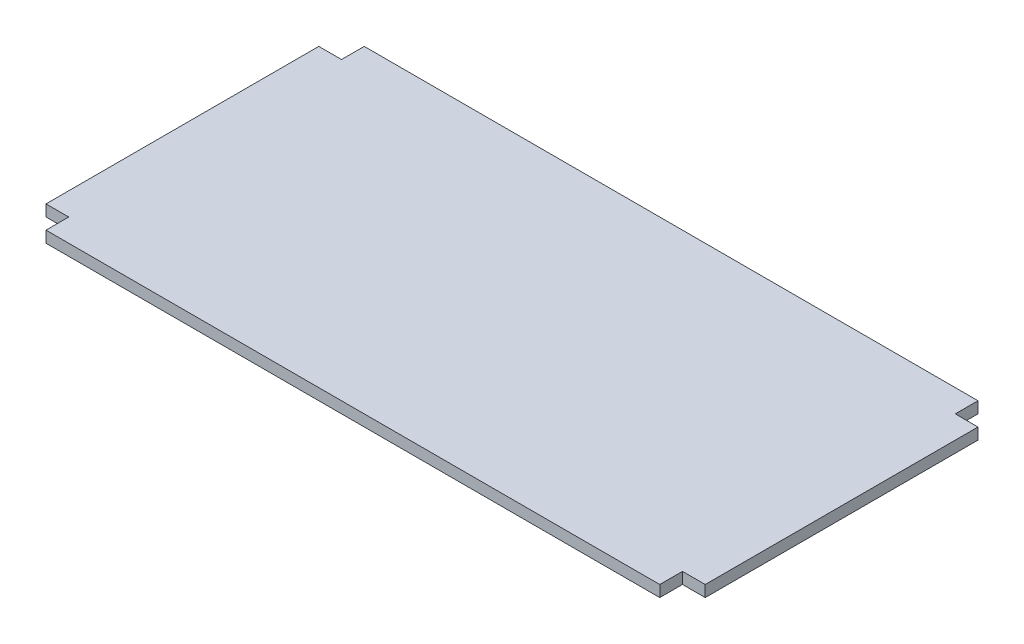
ISO-10303-21;
HEADER;
FILE_DESCRIPTION(('STEP AP214'),'2;1');
FILE_NAME('part.step','',(''),(''),'','','');
FILE_SCHEMA(('AUTOMOTIVE_DESIGN { 1 0 10303 214 1 1 1 1 }'));
ENDSEC;
DATA;
#1=APPLICATION_CONTEXT('core data for automotive mechanical design processes');
#2=APPLICATION_PROTOCOL_DEFINITION('international standard','automotive_design',2000,#1);
#3=PRODUCT_CONTEXT('',#1,'mechanical');
#4=PRODUCT('Part','Part','',(#3));
#5=PRODUCT_RELATED_PRODUCT_CATEGORY('part','',(#4));
#6=PRODUCT_DEFINITION_FORMATION('','',#4);
#7=PRODUCT_DEFINITION_CONTEXT('part definition',#1,'design');
#8=PRODUCT_DEFINITION('design','',#6,#7);
#9=PRODUCT_DEFINITION_SHAPE('','',#8);
#10=(LENGTH_UNIT() NAMED_UNIT(*) SI_UNIT(.MILLI.,.METRE.));
#11=(NAMED_UNIT(*) PLANE_ANGLE_UNIT() SI_UNIT($,.RADIAN.));
#12=(NAMED_UNIT(*) SI_UNIT($,.STERADIAN.) SOLID_ANGLE_UNIT());
#13=UNCERTAINTY_MEASURE_WITH_UNIT(LENGTH_MEASURE(1.E-05),#10,'distance_accuracy_value','');
#14=(GEOMETRIC_REPRESENTATION_CONTEXT(3) GLOBAL_UNCERTAINTY_ASSIGNED_CONTEXT((#13)) GLOBAL_UNIT_ASSIGNED_CONTEXT((#10,
#11,#12)) REPRESENTATION_CONTEXT('',''));
#15=CARTESIAN_POINT('',(0.,0.,0.));
#16=DIRECTION('',(0.,0.,1.));
#17=DIRECTION('',(1.,0.,0.));
#18=AXIS2_PLACEMENT_3D('',#15,#16,#17);
#19=CARTESIAN_POINT('',(0.,12.7,-152.4));
#20=DIRECTION('',(0.,0.,1.));
#21=DIRECTION('',(1.,0.,0.));
#22=AXIS2_PLACEMENT_3D('',#19,#20,#21);
#23=PLANE('',#22);
#24=DIRECTION('',(-1.,0.,0.));
#25=VECTOR('',#24,1.);
#26=CARTESIAN_POINT('',(0.,12.7,-152.4));
#27=LINE('',#26,#25);
#28=CARTESIAN_POINT('',(368.3,12.7,-152.4));
#29=VERTEX_POINT('',#28);
#30=CARTESIAN_POINT('',(342.9,12.7,-152.4));
#31=VERTEX_POINT('',#30);
#32=EDGE_CURVE('E170',#29,#31,#27,.T.);
#33=ORIENTED_EDGE('',*,*,#32,.F.);
#34=DIRECTION('',(0.,1.,0.));
#35=VECTOR('',#34,1.);
#36=CARTESIAN_POINT('',(368.3,0.,-152.4));
#37=LINE('',#36,#35);
#38=CARTESIAN_POINT('',(368.3,0.,-152.4));
#39=VERTEX_POINT('',#38);
#40=EDGE_CURVE('E237',#39,#29,#37,.T.);
#41=ORIENTED_EDGE('',*,*,#40,.F.);
#42=DIRECTION('',(-1.,0.,0.));
#43=VECTOR('',#42,1.);
#44=CARTESIAN_POINT('',(0.,0.,-152.4));
#45=LINE('',#44,#43);
#46=CARTESIAN_POINT('',(342.9,0.,-152.4));
#47=VERTEX_POINT('',#46);
#48=EDGE_CURVE('E197',#39,#47,#45,.T.);
#49=ORIENTED_EDGE('',*,*,#48,.T.);
#50=DIRECTION('',(0.,-1.,0.));
#51=VECTOR('',#50,1.);
#52=CARTESIAN_POINT('',(342.9,12.7,-152.4));
#53=LINE('',#52,#51);
#54=EDGE_CURVE('E11',#31,#47,#53,.T.);
#55=ORIENTED_EDGE('',*,*,#54,.F.);
#56=EDGE_LOOP('',(#33,#41,#49,#55));
#57=FACE_BOUND('',#56,.T.);
#58=ADVANCED_FACE('F40',(#57),#23,.F.);
#59=CARTESIAN_POINT('',(342.9,12.7,-4.99600361081321E-13));
#60=DIRECTION('',(1.,0.,0.));
#61=DIRECTION('',(0.,0.,-1.));
#62=AXIS2_PLACEMENT_3D('',#59,#60,#61);
#63=PLANE('',#62);
#64=DIRECTION('',(0.,1.,0.));
#65=VECTOR('',#64,1.);
#66=CARTESIAN_POINT('',(342.9,0.,-177.8));
#67=LINE('',#66,#65);
#68=CARTESIAN_POINT('',(342.9,0.,-177.8));
#69=VERTEX_POINT('',#68);
#70=CARTESIAN_POINT('',(342.9,12.7,-177.8));
#71=VERTEX_POINT('',#70);
#72=EDGE_CURVE('E55',#69,#71,#67,.T.);
#73=ORIENTED_EDGE('',*,*,#72,.T.);
#74=DIRECTION('',(0.,0.,1.));
#75=VECTOR('',#74,1.);
#76=CARTESIAN_POINT('',(342.9,12.7,-4.99600361081321E-13));
#77=LINE('',#76,#75);
#78=EDGE_CURVE('E217',#71,#31,#77,.T.);
#79=ORIENTED_EDGE('',*,*,#78,.T.);
#80=ORIENTED_EDGE('',*,*,#54,.T.);
#81=DIRECTION('',(0.,0.,1.));
#82=VECTOR('',#81,1.);
#83=CARTESIAN_POINT('',(342.9,0.,-4.99600361081321E-13));
#84=LINE('',#83,#82);
#85=EDGE_CURVE('E194',#69,#47,#84,.T.);
#86=ORIENTED_EDGE('',*,*,#85,.F.);
#87=EDGE_LOOP('',(#73,#79,#80,#86));
#88=FACE_BOUND('',#87,.T.);
#89=ADVANCED_FACE('F270',(#88),#63,.T.);
#90=CARTESIAN_POINT('',(-342.9,12.7,-4.99600361081321E-13));
#91=DIRECTION('',(1.,0.,0.));
#92=DIRECTION('',(0.,0.,-1.));
#93=AXIS2_PLACEMENT_3D('',#90,#91,#92);
#94=PLANE('',#93);
#95=DIRECTION('',(0.,0.,1.));
#96=VECTOR('',#95,1.);
#97=CARTESIAN_POINT('',(-342.9,12.7,-4.99600361081321E-13));
#98=LINE('',#97,#96);
#99=CARTESIAN_POINT('',(-342.9,12.7,-177.8));
#100=VERTEX_POINT('',#99);
#101=CARTESIAN_POINT('',(-342.9,12.7,-152.4));
#102=VERTEX_POINT('',#101);
#103=EDGE_CURVE('E190',#100,#102,#98,.T.);
#104=ORIENTED_EDGE('',*,*,#103,.F.);
#105=DIRECTION('',(0.,1.,0.));
#106=VECTOR('',#105,1.);
#107=CARTESIAN_POINT('',(-342.9,0.,-177.8));
#108=LINE('',#107,#106);
#109=CARTESIAN_POINT('',(-342.9,0.,-177.8));
#110=VERTEX_POINT('',#109);
#111=EDGE_CURVE('E192',#110,#100,#108,.T.);
#112=ORIENTED_EDGE('',*,*,#111,.F.);
#113=DIRECTION('',(0.,0.,1.));
#114=VECTOR('',#113,1.);
#115=CARTESIAN_POINT('',(-342.9,0.,-4.99600361081321E-13));
#116=LINE('',#115,#114);
#117=CARTESIAN_POINT('',(-342.9,0.,-152.4));
#118=VERTEX_POINT('',#117);
#119=EDGE_CURVE('E160',#110,#118,#116,.T.);
#120=ORIENTED_EDGE('',*,*,#119,.T.);
#121=DIRECTION('',(0.,-1.,0.));
#122=VECTOR('',#121,1.);
#123=CARTESIAN_POINT('',(-342.9,12.7,-152.4));
#124=LINE('',#123,#122);
#125=EDGE_CURVE('E48',#102,#118,#124,.T.);
#126=ORIENTED_EDGE('',*,*,#125,.F.);
#127=EDGE_LOOP('',(#104,#112,#120,#126));
#128=FACE_BOUND('',#127,.T.);
#129=ADVANCED_FACE('F188',(#128),#94,.F.);
#130=CARTESIAN_POINT('',(0.,12.7,-152.4));
#131=DIRECTION('',(0.,0.,-1.));
#132=DIRECTION('',(-1.,0.,0.));
#133=AXIS2_PLACEMENT_3D('',#130,#131,#132);
#134=PLANE('',#133);
#135=DIRECTION('',(0.,1.,0.));
#136=VECTOR('',#135,1.);
#137=CARTESIAN_POINT('',(-368.3,0.,-152.4));
#138=LINE('',#137,#136);
#139=CARTESIAN_POINT('',(-368.3,0.,-152.4));
#140=VERTEX_POINT('',#139);
#141=CARTESIAN_POINT('',(-368.3,12.7,-152.4));
#142=VERTEX_POINT('',#141);
#143=EDGE_CURVE('E63',#140,#142,#138,.T.);
#144=ORIENTED_EDGE('',*,*,#143,.T.);
#145=DIRECTION('',(1.,0.,0.));
#146=VECTOR('',#145,1.);
#147=CARTESIAN_POINT('',(0.,12.7,-152.4));
#148=LINE('',#147,#146);
#149=EDGE_CURVE('E184',#142,#102,#148,.T.);
#150=ORIENTED_EDGE('',*,*,#149,.T.);
#151=ORIENTED_EDGE('',*,*,#125,.T.);
#152=DIRECTION('',(1.,0.,0.));
#153=VECTOR('',#152,1.);
#154=CARTESIAN_POINT('',(0.,0.,-152.4));
#155=LINE('',#154,#153);
#156=EDGE_CURVE('E154',#140,#118,#155,.T.);
#157=ORIENTED_EDGE('',*,*,#156,.F.);
#158=EDGE_LOOP('',(#144,#150,#151,#157));
#159=FACE_BOUND('',#158,.T.);
#160=ADVANCED_FACE('F182',(#159),#134,.T.);
#161=CARTESIAN_POINT('',(0.,12.7,152.4));
#162=DIRECTION('',(0.,0.,-1.));
#163=DIRECTION('',(-1.,0.,0.));
#164=AXIS2_PLACEMENT_3D('',#161,#162,#163);
#165=PLANE('',#164);
#166=DIRECTION('',(1.,0.,0.));
#167=VECTOR('',#166,1.);
#168=CARTESIAN_POINT('',(0.,12.7,152.4));
#169=LINE('',#168,#167);
#170=CARTESIAN_POINT('',(-368.3,12.7,152.4));
#171=VERTEX_POINT('',#170);
#172=CARTESIAN_POINT('',(-342.9,12.7,152.4));
#173=VERTEX_POINT('',#172);
#174=EDGE_CURVE('E145',#171,#173,#169,.T.);
#175=ORIENTED_EDGE('',*,*,#174,.F.);
#176=DIRECTION('',(0.,1.,0.));
#177=VECTOR('',#176,1.);
#178=CARTESIAN_POINT('',(-368.3,0.,152.4));
#179=LINE('',#178,#177);
#180=CARTESIAN_POINT('',(-368.3,0.,152.4));
#181=VERTEX_POINT('',#180);
#182=EDGE_CURVE('E129',#181,#171,#179,.T.);
#183=ORIENTED_EDGE('',*,*,#182,.F.);
#184=DIRECTION('',(1.,0.,0.));
#185=VECTOR('',#184,1.);
#186=CARTESIAN_POINT('',(0.,0.,152.4));
#187=LINE('',#186,#185);
#188=CARTESIAN_POINT('',(-342.9,0.,152.4));
#189=VERTEX_POINT('',#188);
#190=EDGE_CURVE('E142',#181,#189,#187,.T.);
#191=ORIENTED_EDGE('',*,*,#190,.T.);
#192=DIRECTION('',(0.,-1.,0.));
#193=VECTOR('',#192,1.);
#194=CARTESIAN_POINT('',(-342.9,12.7,152.4));
#195=LINE('',#194,#193);
#196=EDGE_CURVE('E175',#173,#189,#195,.T.);
#197=ORIENTED_EDGE('',*,*,#196,.F.);
#198=EDGE_LOOP('',(#175,#183,#191,#197));
#199=FACE_BOUND('',#198,.T.);
#200=ADVANCED_FACE('F140',(#199),#165,.F.);
#201=CARTESIAN_POINT('',(-342.9,12.7,0.));
#202=DIRECTION('',(-1.,0.,0.));
#203=DIRECTION('',(0.,0.,1.));
#204=AXIS2_PLACEMENT_3D('',#201,#202,#203);
#205=PLANE('',#204);
#206=DIRECTION('',(0.,1.,0.));
#207=VECTOR('',#206,1.);
#208=CARTESIAN_POINT('',(-342.9,0.,177.8));
#209=LINE('',#208,#207);
#210=CARTESIAN_POINT('',(-342.9,0.,177.8));
#211=VERTEX_POINT('',#210);
#212=CARTESIAN_POINT('',(-342.9,12.7,177.8));
#213=VERTEX_POINT('',#212);
#214=EDGE_CURVE('E226',#211,#213,#209,.T.);
#215=ORIENTED_EDGE('',*,*,#214,.T.);
#216=DIRECTION('',(0.,0.,-1.));
#217=VECTOR('',#216,1.);
#218=CARTESIAN_POINT('',(-342.9,12.7,0.));
#219=LINE('',#218,#217);
#220=EDGE_CURVE('E208',#213,#173,#219,.T.);
#221=ORIENTED_EDGE('',*,*,#220,.T.);
#222=ORIENTED_EDGE('',*,*,#196,.T.);
#223=DIRECTION('',(0.,0.,-1.));
#224=VECTOR('',#223,1.);
#225=CARTESIAN_POINT('',(-342.9,0.,0.));
#226=LINE('',#225,#224);
#227=EDGE_CURVE('E151',#211,#189,#226,.T.);
#228=ORIENTED_EDGE('',*,*,#227,.F.);
#229=EDGE_LOOP('',(#215,#221,#222,#228));
#230=FACE_BOUND('',#229,.T.);
#231=ADVANCED_FACE('F294',(#230),#205,.T.);
#232=CARTESIAN_POINT('',(342.9,12.7,0.));
#233=DIRECTION('',(-1.,0.,0.));
#234=DIRECTION('',(0.,0.,1.));
#235=AXIS2_PLACEMENT_3D('',#232,#233,#234);
#236=PLANE('',#235);
#237=DIRECTION('',(0.,0.,-1.));
#238=VECTOR('',#237,1.);
#239=CARTESIAN_POINT('',(342.9,12.7,0.));
#240=LINE('',#239,#238);
#241=CARTESIAN_POINT('',(342.9,12.7,177.8));
#242=VERTEX_POINT('',#241);
#243=CARTESIAN_POINT('',(342.9,12.7,152.4));
#244=VERTEX_POINT('',#243);
#245=EDGE_CURVE('E204',#242,#244,#240,.T.);
#246=ORIENTED_EDGE('',*,*,#245,.F.);
#247=DIRECTION('',(0.,1.,0.));
#248=VECTOR('',#247,1.);
#249=CARTESIAN_POINT('',(342.9,0.,177.8));
#250=LINE('',#249,#248);
#251=CARTESIAN_POINT('',(342.9,0.,177.8));
#252=VERTEX_POINT('',#251);
#253=EDGE_CURVE('E223',#252,#242,#250,.T.);
#254=ORIENTED_EDGE('',*,*,#253,.F.);
#255=DIRECTION('',(0.,0.,-1.));
#256=VECTOR('',#255,1.);
#257=CARTESIAN_POINT('',(342.9,0.,0.));
#258=LINE('',#257,#256);
#259=CARTESIAN_POINT('',(342.9,0.,152.4));
#260=VERTEX_POINT('',#259);
#261=EDGE_CURVE('E158',#252,#260,#258,.T.);
#262=ORIENTED_EDGE('',*,*,#261,.T.);
#263=DIRECTION('',(0.,-1.,0.));
#264=VECTOR('',#263,1.);
#265=CARTESIAN_POINT('',(342.9,12.7,152.4));
#266=LINE('',#265,#264);
#267=EDGE_CURVE('E171',#244,#260,#266,.T.);
#268=ORIENTED_EDGE('',*,*,#267,.F.);
#269=EDGE_LOOP('',(#246,#254,#262,#268));
#270=FACE_BOUND('',#269,.T.);
#271=ADVANCED_FACE('F289',(#270),#236,.F.);
#272=CARTESIAN_POINT('',(0.,12.7,152.4));
#273=DIRECTION('',(0.,0.,1.));
#274=DIRECTION('',(1.,0.,0.));
#275=AXIS2_PLACEMENT_3D('',#272,#273,#274);
#276=PLANE('',#275);
#277=DIRECTION('',(0.,1.,0.));
#278=VECTOR('',#277,1.);
#279=CARTESIAN_POINT('',(368.3,0.,152.4));
#280=LINE('',#279,#278);
#281=CARTESIAN_POINT('',(368.3,0.,152.4));
#282=VERTEX_POINT('',#281);
#283=CARTESIAN_POINT('',(368.3,12.7,152.4));
#284=VERTEX_POINT('',#283);
#285=EDGE_CURVE('E240',#282,#284,#280,.T.);
#286=ORIENTED_EDGE('',*,*,#285,.T.);
#287=DIRECTION('',(-1.,0.,0.));
#288=VECTOR('',#287,1.);
#289=CARTESIAN_POINT('',(0.,12.7,152.4));
#290=LINE('',#289,#288);
#291=EDGE_CURVE('E176',#284,#244,#290,.T.);
#292=ORIENTED_EDGE('',*,*,#291,.T.);
#293=ORIENTED_EDGE('',*,*,#267,.T.);
#294=DIRECTION('',(-1.,0.,0.));
#295=VECTOR('',#294,1.);
#296=CARTESIAN_POINT('',(0.,0.,152.4));
#297=LINE('',#296,#295);
#298=EDGE_CURVE('E166',#282,#260,#297,.T.);
#299=ORIENTED_EDGE('',*,*,#298,.F.);
#300=EDGE_LOOP('',(#286,#292,#293,#299));
#301=FACE_BOUND('',#300,.T.);
#302=ADVANCED_FACE('F285',(#301),#276,.T.);
#303=CARTESIAN_POINT('',(0.,12.7,0.));
#304=DIRECTION('',(0.,1.,0.));
#305=DIRECTION('',(0.,0.,1.));
#306=AXIS2_PLACEMENT_3D('',#303,#304,#305);
#307=PLANE('',#306);
#308=DIRECTION('',(0.,0.,-1.));
#309=VECTOR('',#308,1.);
#310=CARTESIAN_POINT('',(-368.3,12.7,-152.4));
#311=LINE('',#310,#309);
#312=EDGE_CURVE('E136',#171,#142,#311,.T.);
#313=ORIENTED_EDGE('',*,*,#312,.F.);
#314=ORIENTED_EDGE('',*,*,#174,.T.);
#315=ORIENTED_EDGE('',*,*,#220,.F.);
#316=DIRECTION('',(-1.,0.,0.));
#317=VECTOR('',#316,1.);
#318=CARTESIAN_POINT('',(-342.9,12.7,177.8));
#319=LINE('',#318,#317);
#320=EDGE_CURVE('E232',#242,#213,#319,.T.);
#321=ORIENTED_EDGE('',*,*,#320,.F.);
#322=ORIENTED_EDGE('',*,*,#245,.T.);
#323=ORIENTED_EDGE('',*,*,#291,.F.);
#324=DIRECTION('',(0.,0.,1.));
#325=VECTOR('',#324,1.);
#326=CARTESIAN_POINT('',(368.3,12.7,-152.4));
#327=LINE('',#326,#325);
#328=EDGE_CURVE('E231',#29,#284,#327,.T.);
#329=ORIENTED_EDGE('',*,*,#328,.F.);
#330=ORIENTED_EDGE('',*,*,#32,.T.);
#331=ORIENTED_EDGE('',*,*,#78,.F.);
#332=DIRECTION('',(1.,0.,0.));
#333=VECTOR('',#332,1.);
#334=CARTESIAN_POINT('',(-342.9,12.7,-177.8));
#335=LINE('',#334,#333);
#336=EDGE_CURVE('E245',#100,#71,#335,.T.);
#337=ORIENTED_EDGE('',*,*,#336,.F.);
#338=ORIENTED_EDGE('',*,*,#103,.T.);
#339=ORIENTED_EDGE('',*,*,#149,.F.);
#340=EDGE_LOOP('',(#313,#314,#315,#321,#322,#323,#329,#330,#331,#337,#338,#339));
#341=FACE_BOUND('',#340,.T.);
#342=ADVANCED_FACE('F264',(#341),#307,.T.);
#343=CARTESIAN_POINT('',(0.,0.,0.));
#344=DIRECTION('',(0.,1.,0.));
#345=DIRECTION('',(0.,0.,1.));
#346=AXIS2_PLACEMENT_3D('',#343,#344,#345);
#347=PLANE('',#346);
#348=ORIENTED_EDGE('',*,*,#190,.F.);
#349=DIRECTION('',(0.,0.,-1.));
#350=VECTOR('',#349,1.);
#351=CARTESIAN_POINT('',(-368.3,0.,-152.4));
#352=LINE('',#351,#350);
#353=EDGE_CURVE('E126',#181,#140,#352,.T.);
#354=ORIENTED_EDGE('',*,*,#353,.T.);
#355=ORIENTED_EDGE('',*,*,#156,.T.);
#356=ORIENTED_EDGE('',*,*,#119,.F.);
#357=DIRECTION('',(1.,0.,0.));
#358=VECTOR('',#357,1.);
#359=CARTESIAN_POINT('',(-342.9,0.,-177.8));
#360=LINE('',#359,#358);
#361=EDGE_CURVE('E253',#110,#69,#360,.T.);
#362=ORIENTED_EDGE('',*,*,#361,.T.);
#363=ORIENTED_EDGE('',*,*,#85,.T.);
#364=ORIENTED_EDGE('',*,*,#48,.F.);
#365=DIRECTION('',(0.,0.,1.));
#366=VECTOR('',#365,1.);
#367=CARTESIAN_POINT('',(368.3,0.,-152.4));
#368=LINE('',#367,#366);
#369=EDGE_CURVE('E241',#39,#282,#368,.T.);
#370=ORIENTED_EDGE('',*,*,#369,.T.);
#371=ORIENTED_EDGE('',*,*,#298,.T.);
#372=ORIENTED_EDGE('',*,*,#261,.F.);
#373=DIRECTION('',(-1.,0.,0.));
#374=VECTOR('',#373,1.);
#375=CARTESIAN_POINT('',(-342.9,0.,177.8));
#376=LINE('',#375,#374);
#377=EDGE_CURVE('E227',#252,#211,#376,.T.);
#378=ORIENTED_EDGE('',*,*,#377,.T.);
#379=ORIENTED_EDGE('',*,*,#227,.T.);
#380=EDGE_LOOP('',(#348,#354,#355,#356,#362,#363,#364,#370,#371,#372,#378,#379));
#381=FACE_BOUND('',#380,.T.);
#382=ADVANCED_FACE('F148',(#381),#347,.F.);
#383=CARTESIAN_POINT('',(-342.9,0.,177.8));
#384=DIRECTION('',(0.,0.,-1.));
#385=DIRECTION('',(-1.,0.,0.));
#386=AXIS2_PLACEMENT_3D('',#383,#384,#385);
#387=PLANE('',#386);
#388=ORIENTED_EDGE('',*,*,#320,.T.);
#389=ORIENTED_EDGE('',*,*,#214,.F.);
#390=ORIENTED_EDGE('',*,*,#377,.F.);
#391=ORIENTED_EDGE('',*,*,#253,.T.);
#392=EDGE_LOOP('',(#388,#389,#390,#391));
#393=FACE_BOUND('',#392,.T.);
#394=ADVANCED_FACE('F291',(#393),#387,.F.);
#395=CARTESIAN_POINT('',(368.3,0.,-152.4));
#396=DIRECTION('',(-1.,0.,0.));
#397=DIRECTION('',(0.,0.,1.));
#398=AXIS2_PLACEMENT_3D('',#395,#396,#397);
#399=PLANE('',#398);
#400=ORIENTED_EDGE('',*,*,#328,.T.);
#401=ORIENTED_EDGE('',*,*,#285,.F.);
#402=ORIENTED_EDGE('',*,*,#369,.F.);
#403=ORIENTED_EDGE('',*,*,#40,.T.);
#404=EDGE_LOOP('',(#400,#401,#402,#403));
#405=FACE_BOUND('',#404,.T.);
#406=ADVANCED_FACE('F279',(#405),#399,.F.);
#407=CARTESIAN_POINT('',(-342.9,0.,-177.8));
#408=DIRECTION('',(0.,0.,1.));
#409=DIRECTION('',(1.,0.,0.));
#410=AXIS2_PLACEMENT_3D('',#407,#408,#409);
#411=PLANE('',#410);
#412=ORIENTED_EDGE('',*,*,#336,.T.);
#413=ORIENTED_EDGE('',*,*,#72,.F.);
#414=ORIENTED_EDGE('',*,*,#361,.F.);
#415=ORIENTED_EDGE('',*,*,#111,.T.);
#416=EDGE_LOOP('',(#412,#413,#414,#415));
#417=FACE_BOUND('',#416,.T.);
#418=ADVANCED_FACE('F267',(#417),#411,.F.);
#419=CARTESIAN_POINT('',(-368.3,0.,-152.4));
#420=DIRECTION('',(1.,0.,0.));
#421=DIRECTION('',(0.,0.,-1.));
#422=AXIS2_PLACEMENT_3D('',#419,#420,#421);
#423=PLANE('',#422);
#424=ORIENTED_EDGE('',*,*,#312,.T.);
#425=ORIENTED_EDGE('',*,*,#143,.F.);
#426=ORIENTED_EDGE('',*,*,#353,.F.);
#427=ORIENTED_EDGE('',*,*,#182,.T.);
#428=EDGE_LOOP('',(#424,#425,#426,#427));
#429=FACE_BOUND('',#428,.T.);
#430=ADVANCED_FACE('F128',(#429),#423,.F.);
#431=CLOSED_SHELL('',(#58,#89,#129,#160,#200,#231,#271,#302,#342,#382,#394,#406,#418,#430));
#432=MANIFOLD_SOLID_BREP('B2',#431);
#433=ADVANCED_BREP_SHAPE_REPRESENTATION('',(#18,#432),#14);
#434=SHAPE_DEFINITION_REPRESENTATION(#9,#433);
ENDSEC;
END-ISO-10303-21;
